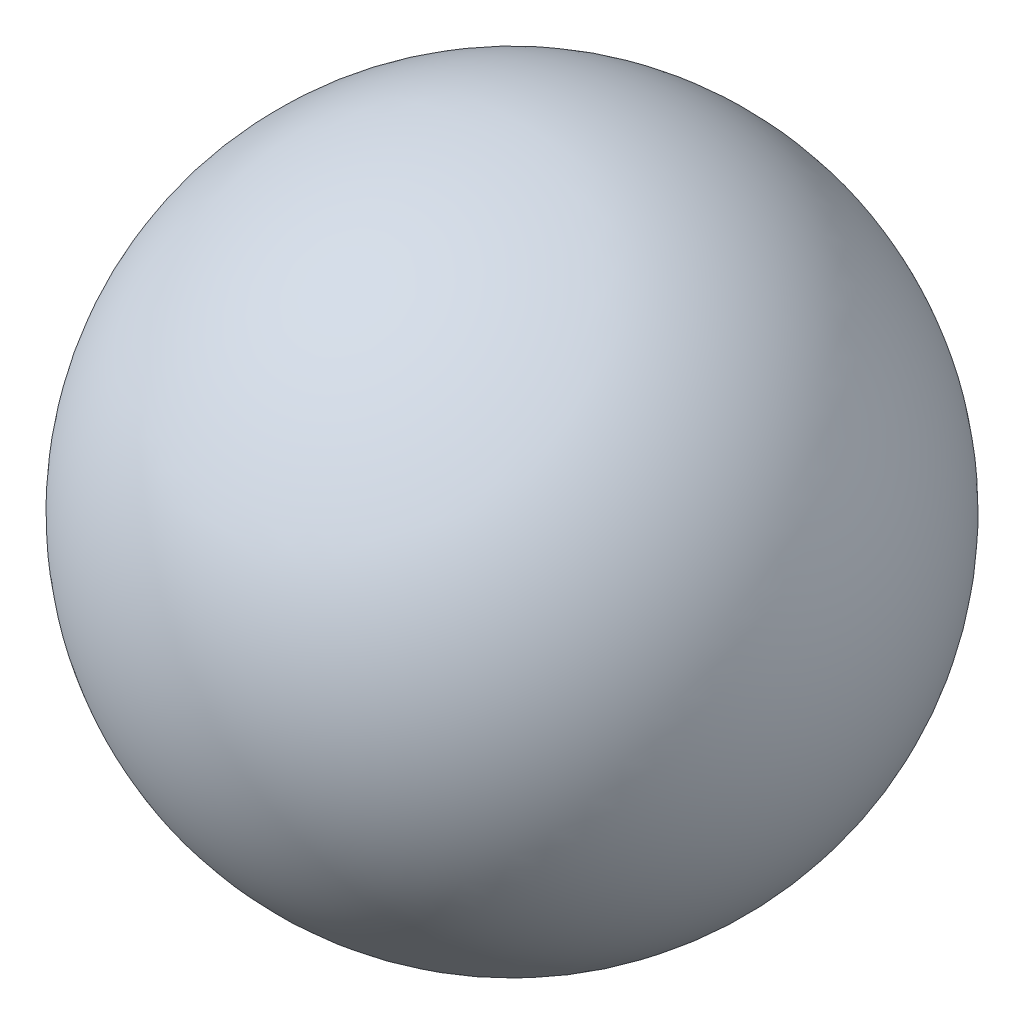
ISO-10303-21;
HEADER;
FILE_DESCRIPTION(('STEP AP214'),'2;1');
FILE_NAME('part.step','',(''),(''),'','','');
FILE_SCHEMA(('AUTOMOTIVE_DESIGN { 1 0 10303 214 1 1 1 1 }'));
ENDSEC;
DATA;
#1=APPLICATION_CONTEXT('core data for automotive mechanical design processes');
#2=APPLICATION_PROTOCOL_DEFINITION('international standard','automotive_design',2000,#1);
#3=PRODUCT_CONTEXT('',#1,'mechanical');
#4=PRODUCT('Part','Part','',(#3));
#5=PRODUCT_RELATED_PRODUCT_CATEGORY('part','',(#4));
#6=PRODUCT_DEFINITION_FORMATION('','',#4);
#7=PRODUCT_DEFINITION_CONTEXT('part definition',#1,'design');
#8=PRODUCT_DEFINITION('design','',#6,#7);
#9=PRODUCT_DEFINITION_SHAPE('','',#8);
#10=(LENGTH_UNIT() NAMED_UNIT(*) SI_UNIT(.MILLI.,.METRE.));
#11=(NAMED_UNIT(*) PLANE_ANGLE_UNIT() SI_UNIT($,.RADIAN.));
#12=(NAMED_UNIT(*) SI_UNIT($,.STERADIAN.) SOLID_ANGLE_UNIT());
#13=UNCERTAINTY_MEASURE_WITH_UNIT(LENGTH_MEASURE(1.E-05),#10,'distance_accuracy_value','');
#14=(GEOMETRIC_REPRESENTATION_CONTEXT(3) GLOBAL_UNCERTAINTY_ASSIGNED_CONTEXT((#13)) GLOBAL_UNIT_ASSIGNED_CONTEXT((#10,
#11,#12)) REPRESENTATION_CONTEXT('',''));
#15=CARTESIAN_POINT('',(0.,0.,0.));
#16=DIRECTION('',(0.,0.,1.));
#17=DIRECTION('',(1.,0.,0.));
#18=AXIS2_PLACEMENT_3D('',#15,#16,#17);
#19=CARTESIAN_POINT('',(0.,-2.,11.75));
#20=DIRECTION('',(0.,0.,1.));
#21=DIRECTION('',(1.,0.,0.));
#22=AXIS2_PLACEMENT_3D('',#19,#20,#21);
#23=SPHERICAL_SURFACE('',#22,1.05);
#24=CARTESIAN_POINT('',(0.,-2.,12.8));
#25=VERTEX_POINT('',#24);
#26=VERTEX_LOOP('',#25);
#27=FACE_BOUND('',#26,.T.);
#28=ADVANCED_FACE('F12',(#27),#23,.T.);
#29=CLOSED_SHELL('',(#28));
#30=MANIFOLD_SOLID_BREP('B1',#29);
#31=ADVANCED_BREP_SHAPE_REPRESENTATION('',(#18,#30),#14);
#32=SHAPE_DEFINITION_REPRESENTATION(#9,#31);
ENDSEC;
END-ISO-10303-21;
